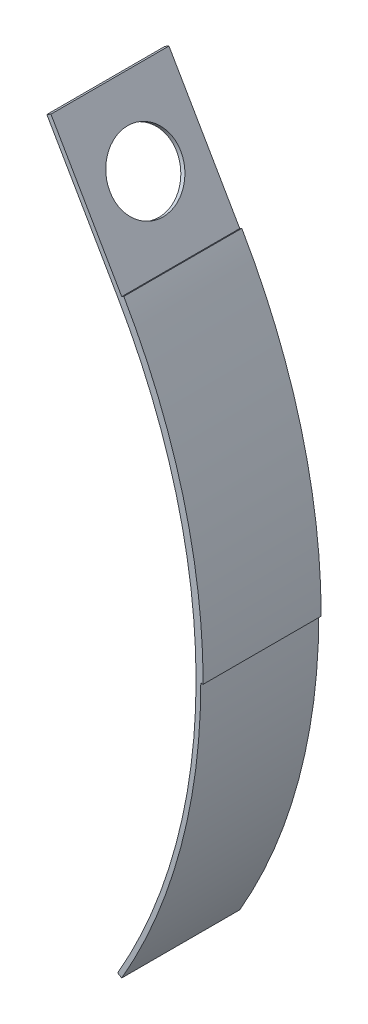
ISO-10303-21;
HEADER;
FILE_DESCRIPTION(('STEP AP214'),'2;1');
FILE_NAME('part.step','',(''),(''),'','','');
FILE_SCHEMA(('AUTOMOTIVE_DESIGN { 1 0 10303 214 1 1 1 1 }'));
ENDSEC;
DATA;
#1=APPLICATION_CONTEXT('core data for automotive mechanical design processes');
#2=APPLICATION_PROTOCOL_DEFINITION('international standard','automotive_design',2000,#1);
#3=PRODUCT_CONTEXT('',#1,'mechanical');
#4=PRODUCT('Part','Part','',(#3));
#5=PRODUCT_RELATED_PRODUCT_CATEGORY('part','',(#4));
#6=PRODUCT_DEFINITION_FORMATION('','',#4);
#7=PRODUCT_DEFINITION_CONTEXT('part definition',#1,'design');
#8=PRODUCT_DEFINITION('design','',#6,#7);
#9=PRODUCT_DEFINITION_SHAPE('','',#8);
#10=(LENGTH_UNIT() NAMED_UNIT(*) SI_UNIT(.MILLI.,.METRE.));
#11=(NAMED_UNIT(*) PLANE_ANGLE_UNIT() SI_UNIT($,.RADIAN.));
#12=(NAMED_UNIT(*) SI_UNIT($,.STERADIAN.) SOLID_ANGLE_UNIT());
#13=UNCERTAINTY_MEASURE_WITH_UNIT(LENGTH_MEASURE(1.E-05),#10,'distance_accuracy_value','');
#14=(GEOMETRIC_REPRESENTATION_CONTEXT(3) GLOBAL_UNCERTAINTY_ASSIGNED_CONTEXT((#13)) GLOBAL_UNIT_ASSIGNED_CONTEXT((#10,
#11,#12)) REPRESENTATION_CONTEXT('',''));
#15=CARTESIAN_POINT('',(0.,0.,0.));
#16=DIRECTION('',(0.,0.,1.));
#17=DIRECTION('',(1.,0.,0.));
#18=AXIS2_PLACEMENT_3D('',#15,#16,#17);
#19=CARTESIAN_POINT('',(-21.650635094611,-12.5,5.));
#20=DIRECTION('',(0.,0.,-1.));
#21=DIRECTION('',(-1.,0.,0.));
#22=AXIS2_PLACEMENT_3D('',#19,#20,#21);
#23=CYLINDRICAL_SURFACE('',#22,24.8);
#24=CARTESIAN_POINT('',(-21.650635094611,-12.5,0.));
#25=DIRECTION('',(0.,0.,1.));
#26=DIRECTION('',(1.,0.,0.));
#27=AXIS2_PLACEMENT_3D('',#24,#25,#26);
#28=CIRCLE('',#27,24.8);
#29=CARTESIAN_POINT('',(-0.173205080756883,-0.100000000000005,0.));
#30=VERTEX_POINT('',#29);
#31=CARTESIAN_POINT('',(-0.173205080756883,-24.9,0.));
#32=VERTEX_POINT('',#31);
#33=EDGE_CURVE('E128',#30,#32,#28,.F.);
#34=ORIENTED_EDGE('',*,*,#33,.T.);
#35=DIRECTION('',(0.,0.,-1.));
#36=VECTOR('',#35,1.);
#37=CARTESIAN_POINT('',(-0.173205080756883,-24.9,5.));
#38=LINE('',#37,#36);
#39=CARTESIAN_POINT('',(-0.173205080756883,-24.9,5.));
#40=VERTEX_POINT('',#39);
#41=EDGE_CURVE('E11',#40,#32,#38,.T.);
#42=ORIENTED_EDGE('',*,*,#41,.F.);
#43=CARTESIAN_POINT('',(-21.650635094611,-12.5,5.));
#44=DIRECTION('',(0.,0.,1.));
#45=DIRECTION('',(1.,0.,0.));
#46=AXIS2_PLACEMENT_3D('',#43,#44,#45);
#47=CIRCLE('',#46,24.8);
#48=CARTESIAN_POINT('',(-0.173205080756883,-0.100000000000005,5.));
#49=VERTEX_POINT('',#48);
#50=EDGE_CURVE('E89',#49,#40,#47,.F.);
#51=ORIENTED_EDGE('',*,*,#50,.F.);
#52=DIRECTION('',(0.,0.,-1.));
#53=VECTOR('',#52,1.);
#54=CARTESIAN_POINT('',(-0.173205080756883,-0.100000000000005,5.));
#55=LINE('',#54,#53);
#56=EDGE_CURVE('E124',#49,#30,#55,.T.);
#57=ORIENTED_EDGE('',*,*,#56,.T.);
#58=EDGE_LOOP('',(#34,#42,#51,#57));
#59=FACE_BOUND('',#58,.T.);
#60=ADVANCED_FACE('F38',(#59),#23,.F.);
#61=CARTESIAN_POINT('',(0.,-25.,5.));
#62=DIRECTION('',(-0.499999999999993,-0.866025403784443,0.));
#63=DIRECTION('',(0.866025403784443,-0.499999999999993,0.));
#64=AXIS2_PLACEMENT_3D('',#61,#62,#63);
#65=PLANE('',#64);
#66=DIRECTION('',(-0.866025403784443,0.499999999999993,0.));
#67=VECTOR('',#66,1.);
#68=CARTESIAN_POINT('',(0.,-25.,0.));
#69=LINE('',#68,#67);
#70=CARTESIAN_POINT('',(0.,-25.,0.));
#71=VERTEX_POINT('',#70);
#72=EDGE_CURVE('E131',#71,#32,#69,.T.);
#73=ORIENTED_EDGE('',*,*,#72,.F.);
#74=DIRECTION('',(0.,0.,-1.));
#75=VECTOR('',#74,1.);
#76=CARTESIAN_POINT('',(0.,-25.,5.));
#77=LINE('',#76,#75);
#78=CARTESIAN_POINT('',(0.,-25.,5.));
#79=VERTEX_POINT('',#78);
#80=EDGE_CURVE('E45',#79,#71,#77,.T.);
#81=ORIENTED_EDGE('',*,*,#80,.F.);
#82=DIRECTION('',(-0.866025403784443,0.499999999999993,0.));
#83=VECTOR('',#82,1.);
#84=CARTESIAN_POINT('',(0.,-25.,5.));
#85=LINE('',#84,#83);
#86=EDGE_CURVE('E193',#79,#40,#85,.T.);
#87=ORIENTED_EDGE('',*,*,#86,.T.);
#88=ORIENTED_EDGE('',*,*,#41,.T.);
#89=EDGE_LOOP('',(#73,#81,#87,#88));
#90=FACE_BOUND('',#89,.T.);
#91=ADVANCED_FACE('F153',(#90),#65,.T.);
#92=CARTESIAN_POINT('',(-21.650635094611,-12.5,5.));
#93=DIRECTION('',(0.,0.,-1.));
#94=DIRECTION('',(-1.,0.,0.));
#95=AXIS2_PLACEMENT_3D('',#92,#93,#94);
#96=CYLINDRICAL_SURFACE('',#95,25.);
#97=DIRECTION('',(0.,0.,-1.));
#98=VECTOR('',#97,1.);
#99=CARTESIAN_POINT('',(3.34936490538903,-12.5,5.));
#100=LINE('',#99,#98);
#101=CARTESIAN_POINT('',(3.34936490538903,-12.5,5.));
#102=VERTEX_POINT('',#101);
#103=CARTESIAN_POINT('',(3.34936490538904,-12.5,0.));
#104=VERTEX_POINT('',#103);
#105=EDGE_CURVE('E188',#102,#104,#100,.T.);
#106=ORIENTED_EDGE('',*,*,#105,.F.);
#107=CARTESIAN_POINT('',(-21.650635094611,-12.5,5.));
#108=DIRECTION('',(0.,0.,-1.));
#109=DIRECTION('',(-1.,0.,0.));
#110=AXIS2_PLACEMENT_3D('',#107,#108,#109);
#111=CIRCLE('',#110,25.);
#112=EDGE_CURVE('E120',#102,#79,#111,.T.);
#113=ORIENTED_EDGE('',*,*,#112,.T.);
#114=ORIENTED_EDGE('',*,*,#80,.T.);
#115=CARTESIAN_POINT('',(-21.650635094611,-12.5,0.));
#116=DIRECTION('',(0.,0.,-1.));
#117=DIRECTION('',(-1.,0.,0.));
#118=AXIS2_PLACEMENT_3D('',#115,#116,#117);
#119=CIRCLE('',#118,25.);
#120=EDGE_CURVE('E135',#104,#71,#119,.T.);
#121=ORIENTED_EDGE('',*,*,#120,.F.);
#122=EDGE_LOOP('',(#106,#113,#114,#121));
#123=FACE_BOUND('',#122,.T.);
#124=ADVANCED_FACE('F149',(#123),#96,.T.);
#125=CARTESIAN_POINT('',(0.,0.,5.));
#126=DIRECTION('',(0.866025403784439,0.5,0.));
#127=DIRECTION('',(-0.5,0.866025403784439,0.));
#128=AXIS2_PLACEMENT_3D('',#125,#126,#127);
#129=PLANE('',#128);
#130=CARTESIAN_POINT('',(-1.5,2.59807621135332,2.5));
#131=DIRECTION('',(0.866025403784439,0.5,0.));
#132=DIRECTION('',(-0.5,0.866025403784439,0.));
#133=AXIS2_PLACEMENT_3D('',#130,#131,#132);
#134=CIRCLE('',#133,1.5);
#135=CARTESIAN_POINT('',(-2.25,3.89711431702998,2.5));
#136=VERTEX_POINT('',#135);
#137=EDGE_CURVE('E132',#136,#136,#134,.T.);
#138=ORIENTED_EDGE('',*,*,#137,.F.);
#139=EDGE_LOOP('',(#138));
#140=FACE_BOUND('',#139,.T.);
#141=DIRECTION('',(0.5,-0.866025403784439,0.));
#142=VECTOR('',#141,1.);
#143=CARTESIAN_POINT('',(0.,0.,0.));
#144=LINE('',#143,#142);
#145=CARTESIAN_POINT('',(-3.,5.19615242270663,0.));
#146=VERTEX_POINT('',#145);
#147=CARTESIAN_POINT('',(0.,0.,0.));
#148=VERTEX_POINT('',#147);
#149=EDGE_CURVE('E106',#146,#148,#144,.T.);
#150=ORIENTED_EDGE('',*,*,#149,.F.);
#151=DIRECTION('',(0.,0.,-1.));
#152=VECTOR('',#151,1.);
#153=CARTESIAN_POINT('',(-3.,5.19615242270663,5.));
#154=LINE('',#153,#152);
#155=CARTESIAN_POINT('',(-3.,5.19615242270663,5.));
#156=VERTEX_POINT('',#155);
#157=EDGE_CURVE('E100',#156,#146,#154,.T.);
#158=ORIENTED_EDGE('',*,*,#157,.F.);
#159=DIRECTION('',(0.5,-0.866025403784439,0.));
#160=VECTOR('',#159,1.);
#161=CARTESIAN_POINT('',(0.,0.,5.));
#162=LINE('',#161,#160);
#163=CARTESIAN_POINT('',(0.,0.,5.));
#164=VERTEX_POINT('',#163);
#165=EDGE_CURVE('E104',#156,#164,#162,.T.);
#166=ORIENTED_EDGE('',*,*,#165,.T.);
#167=DIRECTION('',(0.,0.,-1.));
#168=VECTOR('',#167,1.);
#169=CARTESIAN_POINT('',(0.,0.,5.));
#170=LINE('',#169,#168);
#171=EDGE_CURVE('E111',#164,#148,#170,.T.);
#172=ORIENTED_EDGE('',*,*,#171,.T.);
#173=EDGE_LOOP('',(#150,#158,#166,#172));
#174=FACE_BOUND('',#173,.T.);
#175=ADVANCED_FACE('F102',(#140,#174),#129,.T.);
#176=CARTESIAN_POINT('',(-3.17320508075689,5.09615242270663,5.));
#177=DIRECTION('',(-0.500000000000005,0.866025403784436,0.));
#178=DIRECTION('',(-0.866025403784436,-0.500000000000005,0.));
#179=AXIS2_PLACEMENT_3D('',#176,#177,#178);
#180=PLANE('',#179);
#181=DIRECTION('',(0.866025403784436,0.500000000000005,0.));
#182=VECTOR('',#181,1.);
#183=CARTESIAN_POINT('',(-3.17320508075689,5.09615242270663,0.));
#184=LINE('',#183,#182);
#185=CARTESIAN_POINT('',(-3.17320508075689,5.09615242270663,0.));
#186=VERTEX_POINT('',#185);
#187=EDGE_CURVE('E138',#186,#146,#184,.T.);
#188=ORIENTED_EDGE('',*,*,#187,.F.);
#189=DIRECTION('',(0.,0.,-1.));
#190=VECTOR('',#189,1.);
#191=CARTESIAN_POINT('',(-3.17320508075689,5.09615242270663,5.));
#192=LINE('',#191,#190);
#193=CARTESIAN_POINT('',(-3.17320508075689,5.09615242270663,5.));
#194=VERTEX_POINT('',#193);
#195=EDGE_CURVE('E112',#194,#186,#192,.T.);
#196=ORIENTED_EDGE('',*,*,#195,.F.);
#197=DIRECTION('',(0.866025403784436,0.500000000000005,0.));
#198=VECTOR('',#197,1.);
#199=CARTESIAN_POINT('',(-3.17320508075689,5.09615242270663,5.));
#200=LINE('',#199,#198);
#201=EDGE_CURVE('E116',#194,#156,#200,.T.);
#202=ORIENTED_EDGE('',*,*,#201,.T.);
#203=ORIENTED_EDGE('',*,*,#157,.T.);
#204=EDGE_LOOP('',(#188,#196,#202,#203));
#205=FACE_BOUND('',#204,.T.);
#206=ADVANCED_FACE('F122',(#205),#180,.T.);
#207=CARTESIAN_POINT('',(-0.173205080756888,-0.0999999999999999,5.));
#208=DIRECTION('',(0.866025403784439,0.5,0.));
#209=DIRECTION('',(-0.5,0.866025403784439,0.));
#210=AXIS2_PLACEMENT_3D('',#207,#208,#209);
#211=PLANE('',#210);
#212=CARTESIAN_POINT('',(-1.67320508075689,2.49807621135331,2.5));
#213=DIRECTION('',(-0.866025403784438,-0.500000000000001,0.));
#214=DIRECTION('',(0.500000000000001,-0.866025403784438,0.));
#215=AXIS2_PLACEMENT_3D('',#212,#213,#214);
#216=CIRCLE('',#215,1.5);
#217=CARTESIAN_POINT('',(-0.923205080756888,1.19903810567666,2.5));
#218=VERTEX_POINT('',#217);
#219=EDGE_CURVE('E185',#218,#218,#216,.T.);
#220=ORIENTED_EDGE('',*,*,#219,.F.);
#221=EDGE_LOOP('',(#220));
#222=FACE_BOUND('',#221,.T.);
#223=DIRECTION('',(0.5,-0.866025403784439,0.));
#224=VECTOR('',#223,1.);
#225=CARTESIAN_POINT('',(-0.173205080756888,-0.0999999999999999,0.));
#226=LINE('',#225,#224);
#227=EDGE_CURVE('E83',#186,#30,#226,.T.);
#228=ORIENTED_EDGE('',*,*,#227,.T.);
#229=ORIENTED_EDGE('',*,*,#56,.F.);
#230=DIRECTION('',(0.5,-0.866025403784439,0.));
#231=VECTOR('',#230,1.);
#232=CARTESIAN_POINT('',(-0.173205080756888,-0.0999999999999999,5.));
#233=LINE('',#232,#231);
#234=EDGE_CURVE('E61',#194,#49,#233,.T.);
#235=ORIENTED_EDGE('',*,*,#234,.F.);
#236=ORIENTED_EDGE('',*,*,#195,.T.);
#237=EDGE_LOOP('',(#228,#229,#235,#236));
#238=FACE_BOUND('',#237,.T.);
#239=ADVANCED_FACE('F157',(#222,#238),#211,.F.);
#240=CARTESIAN_POINT('',(-21.650635094611,-12.5,5.));
#241=DIRECTION('',(0.,0.,1.));
#242=DIRECTION('',(1.,0.,0.));
#243=AXIS2_PLACEMENT_3D('',#240,#241,#242);
#244=PLANE('',#243);
#245=ORIENTED_EDGE('',*,*,#50,.T.);
#246=ORIENTED_EDGE('',*,*,#86,.F.);
#247=ORIENTED_EDGE('',*,*,#112,.F.);
#248=DIRECTION('',(-1.,0.,0.));
#249=VECTOR('',#248,1.);
#250=CARTESIAN_POINT('',(3.44936490538903,-12.5,5.));
#251=LINE('',#250,#249);
#252=CARTESIAN_POINT('',(3.44936490538903,-12.5,5.));
#253=VERTEX_POINT('',#252);
#254=EDGE_CURVE('E198',#253,#102,#251,.T.);
#255=ORIENTED_EDGE('',*,*,#254,.F.);
#256=CARTESIAN_POINT('',(-21.6506350946111,-12.5,5.));
#257=DIRECTION('',(0.,0.,1.));
#258=DIRECTION('',(1.,0.,0.));
#259=AXIS2_PLACEMENT_3D('',#256,#257,#258);
#260=CIRCLE('',#259,25.1000000000002);
#261=CARTESIAN_POINT('',(0.0866025403784589,0.0499999999999962,5.));
#262=VERTEX_POINT('',#261);
#263=EDGE_CURVE('E228',#262,#253,#260,.F.);
#264=ORIENTED_EDGE('',*,*,#263,.F.);
#265=DIRECTION('',(0.866025403784443,0.499999999999993,0.));
#266=VECTOR('',#265,1.);
#267=CARTESIAN_POINT('',(0.,0.,5.));
#268=LINE('',#267,#266);
#269=EDGE_CURVE('E119',#164,#262,#268,.T.);
#270=ORIENTED_EDGE('',*,*,#269,.F.);
#271=ORIENTED_EDGE('',*,*,#165,.F.);
#272=ORIENTED_EDGE('',*,*,#201,.F.);
#273=ORIENTED_EDGE('',*,*,#234,.T.);
#274=EDGE_LOOP('',(#245,#246,#247,#255,#264,#270,#271,#272,#273));
#275=FACE_BOUND('',#274,.T.);
#276=ADVANCED_FACE('F115',(#275),#244,.T.);
#277=CARTESIAN_POINT('',(-21.650635094611,-12.5,0.));
#278=DIRECTION('',(0.,0.,1.));
#279=DIRECTION('',(1.,0.,0.));
#280=AXIS2_PLACEMENT_3D('',#277,#278,#279);
#281=PLANE('',#280);
#282=ORIENTED_EDGE('',*,*,#33,.F.);
#283=ORIENTED_EDGE('',*,*,#227,.F.);
#284=ORIENTED_EDGE('',*,*,#187,.T.);
#285=ORIENTED_EDGE('',*,*,#149,.T.);
#286=DIRECTION('',(0.866025403784443,0.499999999999993,0.));
#287=VECTOR('',#286,1.);
#288=CARTESIAN_POINT('',(0.,0.,0.));
#289=LINE('',#288,#287);
#290=CARTESIAN_POINT('',(0.0866025403784589,0.0499999999999962,0.));
#291=VERTEX_POINT('',#290);
#292=EDGE_CURVE('E220',#148,#291,#289,.T.);
#293=ORIENTED_EDGE('',*,*,#292,.T.);
#294=CARTESIAN_POINT('',(-21.6506350946111,-12.5,0.));
#295=DIRECTION('',(0.,0.,1.));
#296=DIRECTION('',(1.,0.,0.));
#297=AXIS2_PLACEMENT_3D('',#294,#295,#296);
#298=CIRCLE('',#297,25.1000000000002);
#299=CARTESIAN_POINT('',(3.44936490538903,-12.5,0.));
#300=VERTEX_POINT('',#299);
#301=EDGE_CURVE('E224',#291,#300,#298,.F.);
#302=ORIENTED_EDGE('',*,*,#301,.T.);
#303=DIRECTION('',(-1.,0.,0.));
#304=VECTOR('',#303,1.);
#305=CARTESIAN_POINT('',(3.44936490538903,-12.5,0.));
#306=LINE('',#305,#304);
#307=EDGE_CURVE('E52',#300,#104,#306,.T.);
#308=ORIENTED_EDGE('',*,*,#307,.T.);
#309=ORIENTED_EDGE('',*,*,#120,.T.);
#310=ORIENTED_EDGE('',*,*,#72,.T.);
#311=EDGE_LOOP('',(#282,#283,#284,#285,#293,#302,#308,#309,#310));
#312=FACE_BOUND('',#311,.T.);
#313=ADVANCED_FACE('F155',(#312),#281,.F.);
#314=CARTESIAN_POINT('',(3.26202367904178,5.34743186433546,2.5));
#315=DIRECTION('',(-0.866025403784438,-0.500000000000001,0.));
#316=DIRECTION('',(0.500000000000001,-0.866025403784438,0.));
#317=AXIS2_PLACEMENT_3D('',#314,#315,#316);
#318=CYLINDRICAL_SURFACE('',#317,1.5);
#319=ORIENTED_EDGE('',*,*,#137,.T.);
#320=EDGE_LOOP('',(#319));
#321=FACE_BOUND('',#320,.T.);
#322=ORIENTED_EDGE('',*,*,#219,.T.);
#323=EDGE_LOOP('',(#322));
#324=FACE_BOUND('',#323,.T.);
#325=ADVANCED_FACE('F236',(#321,#324),#318,.F.);
#326=CARTESIAN_POINT('',(3.44936490538903,-12.5,5.));
#327=DIRECTION('',(0.,-1.,0.));
#328=DIRECTION('',(0.,0.,-1.));
#329=AXIS2_PLACEMENT_3D('',#326,#327,#328);
#330=PLANE('',#329);
#331=ORIENTED_EDGE('',*,*,#307,.F.);
#332=DIRECTION('',(0.,0.,-1.));
#333=VECTOR('',#332,1.);
#334=CARTESIAN_POINT('',(3.44936490538903,-12.5,5.));
#335=LINE('',#334,#333);
#336=EDGE_CURVE('E222',#253,#300,#335,.T.);
#337=ORIENTED_EDGE('',*,*,#336,.F.);
#338=ORIENTED_EDGE('',*,*,#254,.T.);
#339=ORIENTED_EDGE('',*,*,#105,.T.);
#340=EDGE_LOOP('',(#331,#337,#338,#339));
#341=FACE_BOUND('',#340,.T.);
#342=ADVANCED_FACE('F232',(#341),#330,.T.);
#343=CARTESIAN_POINT('',(-21.6506350946111,-12.5,5.));
#344=DIRECTION('',(0.,0.,-1.));
#345=DIRECTION('',(-1.,0.,0.));
#346=AXIS2_PLACEMENT_3D('',#343,#344,#345);
#347=CYLINDRICAL_SURFACE('',#346,25.1000000000002);
#348=ORIENTED_EDGE('',*,*,#301,.F.);
#349=DIRECTION('',(0.,0.,-1.));
#350=VECTOR('',#349,1.);
#351=CARTESIAN_POINT('',(0.0866025403784589,0.0499999999999962,5.));
#352=LINE('',#351,#350);
#353=EDGE_CURVE('E216',#262,#291,#352,.T.);
#354=ORIENTED_EDGE('',*,*,#353,.F.);
#355=ORIENTED_EDGE('',*,*,#263,.T.);
#356=ORIENTED_EDGE('',*,*,#336,.T.);
#357=EDGE_LOOP('',(#348,#354,#355,#356));
#358=FACE_BOUND('',#357,.T.);
#359=ADVANCED_FACE('F225',(#358),#347,.T.);
#360=CARTESIAN_POINT('',(0.,0.,5.));
#361=DIRECTION('',(-0.499999999999993,0.866025403784443,0.));
#362=DIRECTION('',(-0.866025403784443,-0.499999999999993,0.));
#363=AXIS2_PLACEMENT_3D('',#360,#361,#362);
#364=PLANE('',#363);
#365=ORIENTED_EDGE('',*,*,#292,.F.);
#366=ORIENTED_EDGE('',*,*,#171,.F.);
#367=ORIENTED_EDGE('',*,*,#269,.T.);
#368=ORIENTED_EDGE('',*,*,#353,.T.);
#369=EDGE_LOOP('',(#365,#366,#367,#368));
#370=FACE_BOUND('',#369,.T.);
#371=ADVANCED_FACE('F218',(#370),#364,.T.);
#372=CLOSED_SHELL('',(#60,#91,#124,#175,#206,#239,#276,#313,#325,#342,#359,#371));
#373=MANIFOLD_SOLID_BREP('B2',#372);
#374=ADVANCED_BREP_SHAPE_REPRESENTATION('',(#18,#373),#14);
#375=SHAPE_DEFINITION_REPRESENTATION(#9,#374);
ENDSEC;
END-ISO-10303-21;
